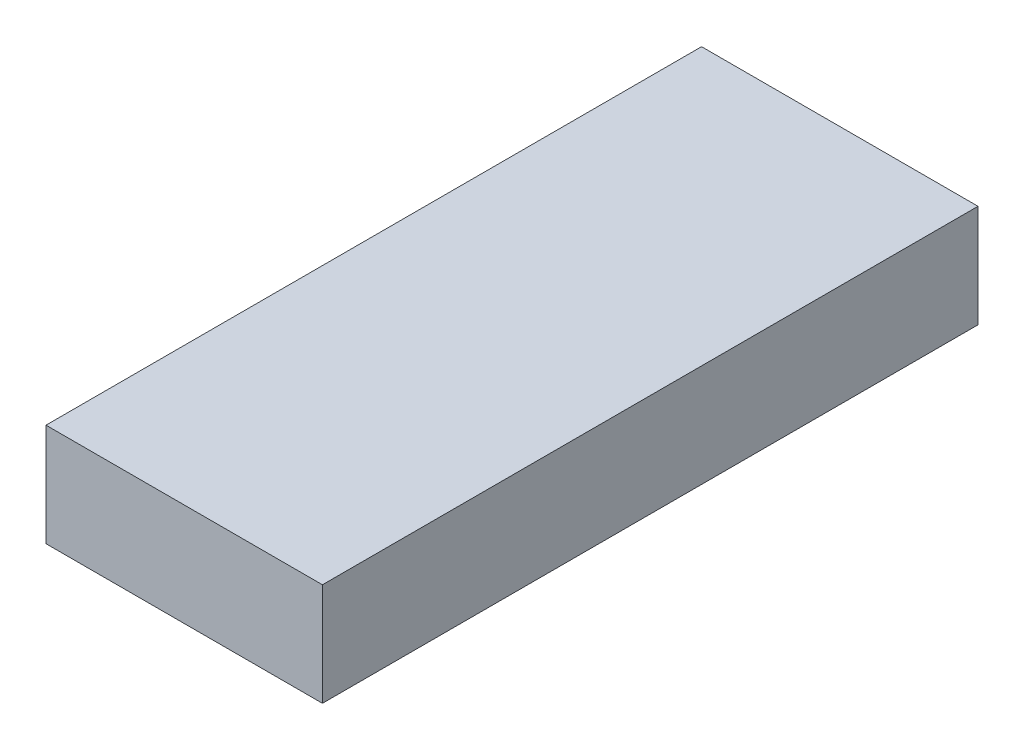
ISO-10303-21;
HEADER;
FILE_DESCRIPTION(('STEP AP214'),'2;1');
FILE_NAME('part.step','',(''),(''),'','','');
FILE_SCHEMA(('AUTOMOTIVE_DESIGN { 1 0 10303 214 1 1 1 1 }'));
ENDSEC;
DATA;
#1=APPLICATION_CONTEXT('core data for automotive mechanical design processes');
#2=APPLICATION_PROTOCOL_DEFINITION('international standard','automotive_design',2000,#1);
#3=PRODUCT_CONTEXT('',#1,'mechanical');
#4=PRODUCT('Part','Part','',(#3));
#5=PRODUCT_RELATED_PRODUCT_CATEGORY('part','',(#4));
#6=PRODUCT_DEFINITION_FORMATION('','',#4);
#7=PRODUCT_DEFINITION_CONTEXT('part definition',#1,'design');
#8=PRODUCT_DEFINITION('design','',#6,#7);
#9=PRODUCT_DEFINITION_SHAPE('','',#8);
#10=(LENGTH_UNIT() NAMED_UNIT(*) SI_UNIT(.MILLI.,.METRE.));
#11=(NAMED_UNIT(*) PLANE_ANGLE_UNIT() SI_UNIT($,.RADIAN.));
#12=(NAMED_UNIT(*) SI_UNIT($,.STERADIAN.) SOLID_ANGLE_UNIT());
#13=UNCERTAINTY_MEASURE_WITH_UNIT(LENGTH_MEASURE(1.E-05),#10,'distance_accuracy_value','');
#14=(GEOMETRIC_REPRESENTATION_CONTEXT(3) GLOBAL_UNCERTAINTY_ASSIGNED_CONTEXT((#13)) GLOBAL_UNIT_ASSIGNED_CONTEXT((#10,
#11,#12)) REPRESENTATION_CONTEXT('',''));
#15=CARTESIAN_POINT('',(0.,0.,0.));
#16=DIRECTION('',(0.,0.,1.));
#17=DIRECTION('',(1.,0.,0.));
#18=AXIS2_PLACEMENT_3D('',#15,#16,#17);
#19=CARTESIAN_POINT('',(-11.8959953467619,4.00353773584906,83.));
#20=DIRECTION('',(1.,0.,0.));
#21=DIRECTION('',(0.,1.,0.));
#22=AXIS2_PLACEMENT_3D('',#19,#20,#21);
#23=PLANE('',#22);
#24=DIRECTION('',(0.,-1.,0.));
#25=VECTOR('',#24,1.);
#26=CARTESIAN_POINT('',(-11.8959953467619,4.00353773584906,0.));
#27=LINE('',#26,#25);
#28=CARTESIAN_POINT('',(-11.8959953467619,4.00353773584906,0.));
#29=VERTEX_POINT('',#28);
#30=CARTESIAN_POINT('',(-11.8959953467618,-8.99646226415094,0.));
#31=VERTEX_POINT('',#30);
#32=EDGE_CURVE('E96',#29,#31,#27,.T.);
#33=ORIENTED_EDGE('',*,*,#32,.T.);
#34=DIRECTION('',(0.,0.,-1.));
#35=VECTOR('',#34,1.);
#36=CARTESIAN_POINT('',(-11.8959953467618,-8.99646226415094,83.));
#37=LINE('',#36,#35);
#38=CARTESIAN_POINT('',(-11.8959953467618,-8.99646226415094,83.));
#39=VERTEX_POINT('',#38);
#40=EDGE_CURVE('E11',#39,#31,#37,.T.);
#41=ORIENTED_EDGE('',*,*,#40,.F.);
#42=DIRECTION('',(0.,-1.,0.));
#43=VECTOR('',#42,1.);
#44=CARTESIAN_POINT('',(-11.8959953467619,4.00353773584906,83.));
#45=LINE('',#44,#43);
#46=CARTESIAN_POINT('',(-11.8959953467619,4.00353773584906,83.));
#47=VERTEX_POINT('',#46);
#48=EDGE_CURVE('E84',#47,#39,#45,.T.);
#49=ORIENTED_EDGE('',*,*,#48,.F.);
#50=DIRECTION('',(0.,0.,-1.));
#51=VECTOR('',#50,1.);
#52=CARTESIAN_POINT('',(-11.8959953467619,4.00353773584906,83.));
#53=LINE('',#52,#51);
#54=EDGE_CURVE('E92',#47,#29,#53,.T.);
#55=ORIENTED_EDGE('',*,*,#54,.T.);
#56=EDGE_LOOP('',(#33,#41,#49,#55));
#57=FACE_BOUND('',#56,.T.);
#58=ADVANCED_FACE('F33',(#57),#23,.F.);
#59=CARTESIAN_POINT('',(-11.8959953467618,-8.99646226415094,83.));
#60=DIRECTION('',(0.,1.,0.));
#61=DIRECTION('',(0.,0.,1.));
#62=AXIS2_PLACEMENT_3D('',#59,#60,#61);
#63=PLANE('',#62);
#64=DIRECTION('',(1.,0.,0.));
#65=VECTOR('',#64,1.);
#66=CARTESIAN_POINT('',(-11.8959953467618,-8.99646226415094,0.));
#67=LINE('',#66,#65);
#68=CARTESIAN_POINT('',(23.1040046532382,-8.99646226415094,0.));
#69=VERTEX_POINT('',#68);
#70=EDGE_CURVE('E88',#31,#69,#67,.T.);
#71=ORIENTED_EDGE('',*,*,#70,.T.);
#72=DIRECTION('',(0.,0.,-1.));
#73=VECTOR('',#72,1.);
#74=CARTESIAN_POINT('',(23.1040046532382,-8.99646226415094,83.));
#75=LINE('',#74,#73);
#76=CARTESIAN_POINT('',(23.1040046532382,-8.99646226415094,83.));
#77=VERTEX_POINT('',#76);
#78=EDGE_CURVE('E41',#77,#69,#75,.T.);
#79=ORIENTED_EDGE('',*,*,#78,.F.);
#80=DIRECTION('',(1.,0.,0.));
#81=VECTOR('',#80,1.);
#82=CARTESIAN_POINT('',(-11.8959953467618,-8.99646226415094,83.));
#83=LINE('',#82,#81);
#84=EDGE_CURVE('E79',#39,#77,#83,.T.);
#85=ORIENTED_EDGE('',*,*,#84,.F.);
#86=ORIENTED_EDGE('',*,*,#40,.T.);
#87=EDGE_LOOP('',(#71,#79,#85,#86));
#88=FACE_BOUND('',#87,.T.);
#89=ADVANCED_FACE('F87',(#88),#63,.F.);
#90=CARTESIAN_POINT('',(23.1040046532382,4.00353773584906,83.));
#91=DIRECTION('',(-1.,0.,0.));
#92=DIRECTION('',(0.,-1.,0.));
#93=AXIS2_PLACEMENT_3D('',#90,#91,#92);
#94=PLANE('',#93);
#95=DIRECTION('',(0.,1.,0.));
#96=VECTOR('',#95,1.);
#97=CARTESIAN_POINT('',(23.1040046532382,4.00353773584906,0.));
#98=LINE('',#97,#96);
#99=CARTESIAN_POINT('',(23.1040046532382,4.00353773584906,0.));
#100=VERTEX_POINT('',#99);
#101=EDGE_CURVE('E66',#69,#100,#98,.T.);
#102=ORIENTED_EDGE('',*,*,#101,.T.);
#103=DIRECTION('',(0.,0.,-1.));
#104=VECTOR('',#103,1.);
#105=CARTESIAN_POINT('',(23.1040046532382,4.00353773584906,83.));
#106=LINE('',#105,#104);
#107=CARTESIAN_POINT('',(23.1040046532382,4.00353773584906,83.));
#108=VERTEX_POINT('',#107);
#109=EDGE_CURVE('E89',#108,#100,#106,.T.);
#110=ORIENTED_EDGE('',*,*,#109,.F.);
#111=DIRECTION('',(0.,1.,0.));
#112=VECTOR('',#111,1.);
#113=CARTESIAN_POINT('',(23.1040046532382,4.00353773584906,83.));
#114=LINE('',#113,#112);
#115=EDGE_CURVE('E82',#77,#108,#114,.T.);
#116=ORIENTED_EDGE('',*,*,#115,.F.);
#117=ORIENTED_EDGE('',*,*,#78,.T.);
#118=EDGE_LOOP('',(#102,#110,#116,#117));
#119=FACE_BOUND('',#118,.T.);
#120=ADVANCED_FACE('F90',(#119),#94,.F.);
#121=CARTESIAN_POINT('',(-11.8959953467619,4.00353773584906,83.));
#122=DIRECTION('',(0.,-1.,0.));
#123=DIRECTION('',(0.,0.,-1.));
#124=AXIS2_PLACEMENT_3D('',#121,#122,#123);
#125=PLANE('',#124);
#126=DIRECTION('',(-1.,0.,0.));
#127=VECTOR('',#126,1.);
#128=CARTESIAN_POINT('',(-11.8959953467619,4.00353773584906,0.));
#129=LINE('',#128,#127);
#130=EDGE_CURVE('E72',#100,#29,#129,.T.);
#131=ORIENTED_EDGE('',*,*,#130,.T.);
#132=ORIENTED_EDGE('',*,*,#54,.F.);
#133=DIRECTION('',(-1.,0.,0.));
#134=VECTOR('',#133,1.);
#135=CARTESIAN_POINT('',(-11.8959953467619,4.00353773584906,83.));
#136=LINE('',#135,#134);
#137=EDGE_CURVE('E49',#108,#47,#136,.T.);
#138=ORIENTED_EDGE('',*,*,#137,.F.);
#139=ORIENTED_EDGE('',*,*,#109,.T.);
#140=EDGE_LOOP('',(#131,#132,#138,#139));
#141=FACE_BOUND('',#140,.T.);
#142=ADVANCED_FACE('F103',(#141),#125,.F.);
#143=CARTESIAN_POINT('',(0.,0.,83.));
#144=DIRECTION('',(0.,0.,1.));
#145=DIRECTION('',(1.,0.,0.));
#146=AXIS2_PLACEMENT_3D('',#143,#144,#145);
#147=PLANE('',#146);
#148=ORIENTED_EDGE('',*,*,#48,.T.);
#149=ORIENTED_EDGE('',*,*,#84,.T.);
#150=ORIENTED_EDGE('',*,*,#115,.T.);
#151=ORIENTED_EDGE('',*,*,#137,.T.);
#152=EDGE_LOOP('',(#148,#149,#150,#151));
#153=FACE_BOUND('',#152,.T.);
#154=ADVANCED_FACE('F80',(#153),#147,.T.);
#155=CARTESIAN_POINT('',(0.,0.,0.));
#156=DIRECTION('',(0.,0.,1.));
#157=DIRECTION('',(1.,0.,0.));
#158=AXIS2_PLACEMENT_3D('',#155,#156,#157);
#159=PLANE('',#158);
#160=ORIENTED_EDGE('',*,*,#32,.F.);
#161=ORIENTED_EDGE('',*,*,#130,.F.);
#162=ORIENTED_EDGE('',*,*,#101,.F.);
#163=ORIENTED_EDGE('',*,*,#70,.F.);
#164=EDGE_LOOP('',(#160,#161,#162,#163));
#165=FACE_BOUND('',#164,.T.);
#166=ADVANCED_FACE('F106',(#165),#159,.F.);
#167=CLOSED_SHELL('',(#58,#89,#120,#142,#154,#166));
#168=MANIFOLD_SOLID_BREP('B2',#167);
#169=ADVANCED_BREP_SHAPE_REPRESENTATION('',(#18,#168),#14);
#170=SHAPE_DEFINITION_REPRESENTATION(#9,#169);
ENDSEC;
END-ISO-10303-21;
